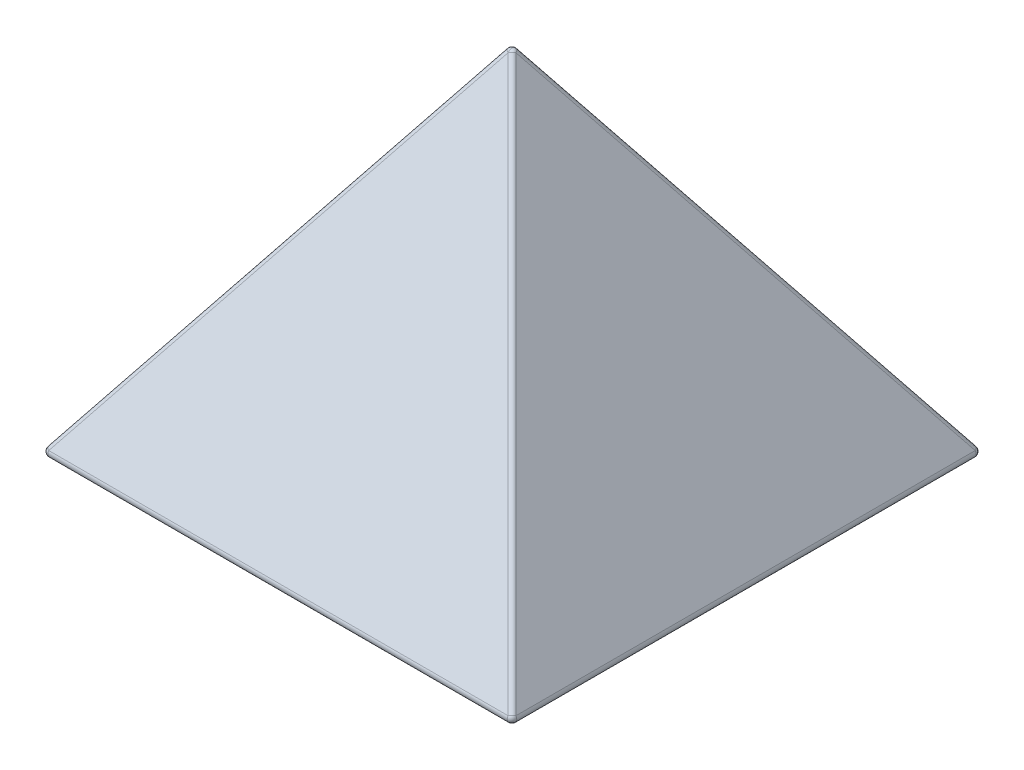
ISO-10303-21;
HEADER;
FILE_DESCRIPTION(('STEP AP214'),'2;1');
FILE_NAME('part.step','',(''),(''),'','','');
FILE_SCHEMA(('AUTOMOTIVE_DESIGN { 1 0 10303 214 1 1 1 1 }'));
ENDSEC;
DATA;
#1=APPLICATION_CONTEXT('core data for automotive mechanical design processes');
#2=APPLICATION_PROTOCOL_DEFINITION('international standard','automotive_design',2000,#1);
#3=PRODUCT_CONTEXT('',#1,'mechanical');
#4=PRODUCT('Part','Part','',(#3));
#5=PRODUCT_RELATED_PRODUCT_CATEGORY('part','',(#4));
#6=PRODUCT_DEFINITION_FORMATION('','',#4);
#7=PRODUCT_DEFINITION_CONTEXT('part definition',#1,'design');
#8=PRODUCT_DEFINITION('design','',#6,#7);
#9=PRODUCT_DEFINITION_SHAPE('','',#8);
#10=(LENGTH_UNIT() NAMED_UNIT(*) SI_UNIT(.MILLI.,.METRE.));
#11=(NAMED_UNIT(*) PLANE_ANGLE_UNIT() SI_UNIT($,.RADIAN.));
#12=(NAMED_UNIT(*) SI_UNIT($,.STERADIAN.) SOLID_ANGLE_UNIT());
#13=UNCERTAINTY_MEASURE_WITH_UNIT(LENGTH_MEASURE(1.E-05),#10,'distance_accuracy_value','');
#14=(GEOMETRIC_REPRESENTATION_CONTEXT(3) GLOBAL_UNCERTAINTY_ASSIGNED_CONTEXT((#13)) GLOBAL_UNIT_ASSIGNED_CONTEXT((#10,
#11,#12)) REPRESENTATION_CONTEXT('',''));
#15=CARTESIAN_POINT('',(0.,0.,0.));
#16=DIRECTION('',(0.,0.,1.));
#17=DIRECTION('',(1.,0.,0.));
#18=AXIS2_PLACEMENT_3D('',#15,#16,#17);
#19=CARTESIAN_POINT('',(0.,2.54,0.));
#20=DIRECTION('',(0.,-1.,0.));
#21=DIRECTION('',(0.,0.,-1.));
#22=AXIS2_PLACEMENT_3D('',#19,#20,#21);
#23=PLANE('',#22);
#24=DIRECTION('',(-1.,0.,0.));
#25=VECTOR('',#24,1.);
#26=CARTESIAN_POINT('',(0.,2.54,-46.0539665867738));
#27=LINE('',#26,#25);
#28=CARTESIAN_POINT('',(46.0539665867738,2.54,-46.0539665867738));
#29=VERTEX_POINT('',#28);
#30=CARTESIAN_POINT('',(-31.5228230502122,2.54000000000002,-46.0539665867738));
#31=VERTEX_POINT('',#30);
#32=EDGE_CURVE('E159',#29,#31,#27,.T.);
#33=ORIENTED_EDGE('',*,*,#32,.T.);
#34=CARTESIAN_POINT('',(-39.3939769497878,2.54000000000002,-46.0539665867738));
#35=VERTEX_POINT('',#34);
#36=EDGE_CURVE('E149',#31,#35,#27,.T.);
#37=ORIENTED_EDGE('',*,*,#36,.T.);
#38=CARTESIAN_POINT('',(-46.0539665867738,2.54,-46.0539665867738));
#39=VERTEX_POINT('',#38);
#40=EDGE_CURVE('E150',#35,#39,#27,.T.);
#41=ORIENTED_EDGE('',*,*,#40,.T.);
#42=DIRECTION('',(0.,0.,1.));
#43=VECTOR('',#42,1.);
#44=CARTESIAN_POINT('',(-46.0539665867738,2.54,0.));
#45=LINE('',#44,#43);
#46=CARTESIAN_POINT('',(-46.0539665867738,2.54,46.0539665867738));
#47=VERTEX_POINT('',#46);
#48=EDGE_CURVE('E166',#39,#47,#45,.T.);
#49=ORIENTED_EDGE('',*,*,#48,.T.);
#50=DIRECTION('',(1.,0.,0.));
#51=VECTOR('',#50,1.);
#52=CARTESIAN_POINT('',(0.,2.54,46.0539665867738));
#53=LINE('',#52,#51);
#54=CARTESIAN_POINT('',(46.0539665867738,2.54,46.0539665867738));
#55=VERTEX_POINT('',#54);
#56=EDGE_CURVE('E161',#47,#55,#53,.T.);
#57=ORIENTED_EDGE('',*,*,#56,.T.);
#58=DIRECTION('',(0.,0.,-1.));
#59=VECTOR('',#58,1.);
#60=CARTESIAN_POINT('',(46.0539665867738,2.54,0.));
#61=LINE('',#60,#59);
#62=EDGE_CURVE('E176',#55,#29,#61,.T.);
#63=ORIENTED_EDGE('',*,*,#62,.T.);
#64=EDGE_LOOP('',(#33,#37,#41,#49,#57,#63));
#65=FACE_BOUND('',#64,.T.);
#66=ADVANCED_FACE('F46',(#65),#23,.F.);
#67=CARTESIAN_POINT('',(33.0558230216126,22.0372153477418,0.));
#68=DIRECTION('',(0.832050294337844,0.554700196225229,0.));
#69=DIRECTION('',(-0.554700196225229,0.832050294337844,0.));
#70=AXIS2_PLACEMENT_3D('',#67,#68,#69);
#71=PLANE('',#70);
#72=ORIENTED_EDGE('',*,*,#62,.F.);
#73=DIRECTION('',(0.485071250072666,-0.727606875108999,0.485071250072666));
#74=VECTOR('',#73,1.);
#75=CARTESIAN_POINT('',(25.277982310645,33.7039764141933,25.277982310645));
#76=LINE('',#75,#74);
#77=CARTESIAN_POINT('',(0.,71.6209498801607,0.));
#78=VERTEX_POINT('',#77);
#79=EDGE_CURVE('E173',#78,#55,#76,.T.);
#80=ORIENTED_EDGE('',*,*,#79,.F.);
#81=DIRECTION('',(0.485071250072666,-0.727606875108999,-0.485071250072666));
#82=VECTOR('',#81,1.);
#83=CARTESIAN_POINT('',(25.277982310645,33.7039764141933,-25.277982310645));
#84=LINE('',#83,#82);
#85=EDGE_CURVE('E172',#78,#29,#84,.T.);
#86=ORIENTED_EDGE('',*,*,#85,.T.);
#87=EDGE_LOOP('',(#72,#80,#86));
#88=FACE_BOUND('',#87,.T.);
#89=ADVANCED_FACE('F296',(#88),#71,.F.);
#90=CARTESIAN_POINT('',(0.,22.0372153477418,-33.0558230216126));
#91=DIRECTION('',(0.,0.554700196225229,-0.832050294337844));
#92=DIRECTION('',(0.,0.832050294337844,0.554700196225229));
#93=AXIS2_PLACEMENT_3D('',#90,#91,#92);
#94=PLANE('',#93);
#95=ORIENTED_EDGE('',*,*,#40,.F.);
#96=CARTESIAN_POINT('',(-35.4584,5.98798861825136,-43.7553075079396));
#97=DIRECTION('',(0.,0.554700196225229,-0.832050294337844));
#98=DIRECTION('',(0.,0.832050294337844,0.554700196225229));
#99=AXIS2_PLACEMENT_3D('',#96,#97,#98);
#100=CIRCLE('',#99,5.71499999999992);
#101=EDGE_CURVE('E134',#35,#31,#100,.T.);
#102=ORIENTED_EDGE('',*,*,#101,.T.);
#103=ORIENTED_EDGE('',*,*,#32,.F.);
#104=ORIENTED_EDGE('',*,*,#85,.F.);
#105=DIRECTION('',(-0.485071250072666,-0.727606875108999,-0.485071250072666));
#106=VECTOR('',#105,1.);
#107=CARTESIAN_POINT('',(-25.277982310645,33.7039764141933,-25.277982310645));
#108=LINE('',#107,#106);
#109=EDGE_CURVE('E154',#78,#39,#108,.T.);
#110=ORIENTED_EDGE('',*,*,#109,.T.);
#111=EDGE_LOOP('',(#95,#102,#103,#104,#110));
#112=FACE_BOUND('',#111,.T.);
#113=ADVANCED_FACE('F152',(#112),#94,.F.);
#114=CARTESIAN_POINT('',(0.,22.0372153477418,33.0558230216126));
#115=DIRECTION('',(0.,0.554700196225229,0.832050294337844));
#116=DIRECTION('',(0.,-0.832050294337844,0.554700196225229));
#117=AXIS2_PLACEMENT_3D('',#114,#115,#116);
#118=PLANE('',#117);
#119=ORIENTED_EDGE('',*,*,#56,.F.);
#120=DIRECTION('',(-0.485071250072666,-0.727606875108999,0.485071250072666));
#121=VECTOR('',#120,1.);
#122=CARTESIAN_POINT('',(-25.277982310645,33.7039764141933,25.277982310645));
#123=LINE('',#122,#121);
#124=EDGE_CURVE('E169',#78,#47,#123,.T.);
#125=ORIENTED_EDGE('',*,*,#124,.F.);
#126=ORIENTED_EDGE('',*,*,#79,.T.);
#127=EDGE_LOOP('',(#119,#125,#126));
#128=FACE_BOUND('',#127,.T.);
#129=ADVANCED_FACE('F309',(#128),#118,.F.);
#130=CARTESIAN_POINT('',(-33.0558230216126,22.0372153477418,0.));
#131=DIRECTION('',(-0.832050294337844,0.554700196225229,0.));
#132=DIRECTION('',(-0.554700196225229,-0.832050294337844,0.));
#133=AXIS2_PLACEMENT_3D('',#130,#131,#132);
#134=PLANE('',#133);
#135=ORIENTED_EDGE('',*,*,#48,.F.);
#136=ORIENTED_EDGE('',*,*,#109,.F.);
#137=ORIENTED_EDGE('',*,*,#124,.T.);
#138=EDGE_LOOP('',(#135,#136,#137));
#139=FACE_BOUND('',#138,.T.);
#140=ADVANCED_FACE('F306',(#139),#134,.F.);
#141=CARTESIAN_POINT('',(-35.4584,5.98798861825136,-43.7553075079396));
#142=DIRECTION('',(0.,0.554700196225229,-0.832050294337844));
#143=DIRECTION('',(0.,0.832050294337844,0.554700196225229));
#144=AXIS2_PLACEMENT_3D('',#141,#142,#143);
#145=CYLINDRICAL_SURFACE('',#144,5.71499999999992);
#146=EDGE_CURVE('E138',#31,#35,#100,.T.);
#147=ORIENTED_EDGE('',*,*,#146,.F.);
#148=ORIENTED_EDGE('',*,*,#101,.F.);
#149=EDGE_LOOP('',(#147,#148));
#150=FACE_BOUND('',#149,.T.);
#151=CARTESIAN_POINT('',(-35.4584,7.39692711666344,-45.8687152555577));
#152=DIRECTION('',(0.,0.554700196225229,-0.832050294337844));
#153=DIRECTION('',(0.,0.832050294337844,0.554700196225229));
#154=AXIS2_PLACEMENT_3D('',#151,#152,#153);
#155=CIRCLE('',#154,5.71499999999992);
#156=CARTESIAN_POINT('',(-35.4584,12.1520945488042,-42.6986036341306));
#157=VERTEX_POINT('',#156);
#158=EDGE_CURVE('E144',#157,#157,#155,.T.);
#159=ORIENTED_EDGE('',*,*,#158,.T.);
#160=EDGE_LOOP('',(#159));
#161=FACE_BOUND('',#160,.T.);
#162=ADVANCED_FACE('F136',(#150,#161),#145,.F.);
#163=CARTESIAN_POINT('',(-35.4584,5.98798861825136,-43.7553075079396));
#164=DIRECTION('',(0.,0.554700196225229,-0.832050294337844));
#165=DIRECTION('',(0.,0.832050294337844,0.554700196225229));
#166=AXIS2_PLACEMENT_3D('',#163,#164,#165);
#167=PLANE('',#166);
#168=ORIENTED_EDGE('',*,*,#146,.T.);
#169=ORIENTED_EDGE('',*,*,#36,.F.);
#170=EDGE_LOOP('',(#168,#169));
#171=FACE_BOUND('',#170,.T.);
#172=ADVANCED_FACE('F147',(#171),#167,.T.);
#173=CARTESIAN_POINT('',(0.,0.,0.));
#174=DIRECTION('',(0.,-1.,0.));
#175=DIRECTION('',(0.,0.,-1.));
#176=AXIS2_PLACEMENT_3D('',#173,#174,#175);
#177=PLANE('',#176);
#178=DIRECTION('',(0.,0.,-1.));
#179=VECTOR('',#178,1.);
#180=CARTESIAN_POINT('',(48.9015866347095,0.,0.));
#181=LINE('',#180,#179);
#182=CARTESIAN_POINT('',(48.9015866347095,0.,-48.9015866347095));
#183=VERTEX_POINT('',#182);
#184=CARTESIAN_POINT('',(48.9015866347095,0.,48.9015866347095));
#185=VERTEX_POINT('',#184);
#186=EDGE_CURVE('E183',#183,#185,#181,.F.);
#187=ORIENTED_EDGE('',*,*,#186,.T.);
#188=DIRECTION('',(1.,0.,0.));
#189=VECTOR('',#188,1.);
#190=CARTESIAN_POINT('',(0.,0.,48.9015866347095));
#191=LINE('',#190,#189);
#192=CARTESIAN_POINT('',(-48.9015866347095,0.,48.9015866347095));
#193=VERTEX_POINT('',#192);
#194=EDGE_CURVE('E188',#185,#193,#191,.F.);
#195=ORIENTED_EDGE('',*,*,#194,.T.);
#196=DIRECTION('',(0.,0.,1.));
#197=VECTOR('',#196,1.);
#198=CARTESIAN_POINT('',(-48.9015866347095,0.,0.));
#199=LINE('',#198,#197);
#200=CARTESIAN_POINT('',(-48.9015866347095,0.,-48.9015866347095));
#201=VERTEX_POINT('',#200);
#202=EDGE_CURVE('E186',#193,#201,#199,.F.);
#203=ORIENTED_EDGE('',*,*,#202,.T.);
#204=DIRECTION('',(-1.,0.,0.));
#205=VECTOR('',#204,1.);
#206=CARTESIAN_POINT('',(0.,0.,-48.9015866347095));
#207=LINE('',#206,#205);
#208=EDGE_CURVE('E181',#201,#183,#207,.F.);
#209=ORIENTED_EDGE('',*,*,#208,.T.);
#210=EDGE_LOOP('',(#187,#195,#203,#209));
#211=FACE_BOUND('',#210,.T.);
#212=ADVANCED_FACE('F271',(#211),#177,.T.);
#213=CARTESIAN_POINT('',(-35.1692307692308,23.4461538461538,0.));
#214=DIRECTION('',(-0.832050294337844,0.554700196225229,0.));
#215=DIRECTION('',(-0.554700196225229,-0.832050294337844,0.));
#216=AXIS2_PLACEMENT_3D('',#213,#214,#215);
#217=PLANE('',#216);
#218=DIRECTION('',(0.,0.,1.));
#219=VECTOR('',#218,1.);
#220=CARTESIAN_POINT('',(-49.7469497337568,1.57957539936483,0.));
#221=LINE('',#220,#219);
#222=CARTESIAN_POINT('',(-49.7469497337568,1.57957539936483,-48.9015866347095));
#223=VERTEX_POINT('',#222);
#224=CARTESIAN_POINT('',(-49.7469497337568,1.57957539936483,48.9015866347095));
#225=VERTEX_POINT('',#224);
#226=EDGE_CURVE('E193',#223,#225,#221,.T.);
#227=ORIENTED_EDGE('',*,*,#226,.T.);
#228=DIRECTION('',(-0.485071250072666,-0.727606875108999,0.485071250072666));
#229=VECTOR('',#228,1.);
#230=CARTESIAN_POINT('',(-27.0930266115405,35.5604600826892,26.2476635124933));
#231=LINE('',#230,#229);
#232=CARTESIAN_POINT('',(-0.845363099047234,74.9319553514291,0.));
#233=VERTEX_POINT('',#232);
#234=EDGE_CURVE('E12',#225,#233,#231,.F.);
#235=ORIENTED_EDGE('',*,*,#234,.T.);
#236=DIRECTION('',(-0.485071250072666,-0.727606875108999,-0.485071250072666));
#237=VECTOR('',#236,1.);
#238=CARTESIAN_POINT('',(-27.0930266115405,35.5604600826892,-26.2476635124933));
#239=LINE('',#238,#237);
#240=EDGE_CURVE('E191',#233,#223,#239,.T.);
#241=ORIENTED_EDGE('',*,*,#240,.T.);
#242=EDGE_LOOP('',(#227,#235,#241));
#243=FACE_BOUND('',#242,.T.);
#244=ADVANCED_FACE('F284',(#243),#217,.T.);
#245=CARTESIAN_POINT('',(0.,23.4461538461538,35.1692307692308));
#246=DIRECTION('',(0.,0.554700196225229,0.832050294337844));
#247=DIRECTION('',(0.,-0.832050294337844,0.554700196225229));
#248=AXIS2_PLACEMENT_3D('',#245,#246,#247);
#249=PLANE('',#248);
#250=DIRECTION('',(1.,0.,0.));
#251=VECTOR('',#250,1.);
#252=CARTESIAN_POINT('',(0.,1.57957539936483,49.7469497337568));
#253=LINE('',#252,#251);
#254=CARTESIAN_POINT('',(-48.9015866347095,1.57957539936483,49.7469497337568));
#255=VERTEX_POINT('',#254);
#256=CARTESIAN_POINT('',(48.9015866347095,1.57957539936483,49.7469497337568));
#257=VERTEX_POINT('',#256);
#258=EDGE_CURVE('E179',#255,#257,#253,.T.);
#259=ORIENTED_EDGE('',*,*,#258,.T.);
#260=DIRECTION('',(0.485071250072666,-0.727606875108999,0.485071250072666));
#261=VECTOR('',#260,1.);
#262=CARTESIAN_POINT('',(26.2476635124933,35.5604600826892,27.0930266115405));
#263=LINE('',#262,#261);
#264=CARTESIAN_POINT('',(0.,74.9319553514291,0.845363099047254));
#265=VERTEX_POINT('',#264);
#266=EDGE_CURVE('E55',#257,#265,#263,.F.);
#267=ORIENTED_EDGE('',*,*,#266,.T.);
#268=DIRECTION('',(-0.485071250072666,-0.727606875108999,0.485071250072666));
#269=VECTOR('',#268,1.);
#270=CARTESIAN_POINT('',(-26.2476635124933,35.5604600826892,27.0930266115405));
#271=LINE('',#270,#269);
#272=EDGE_CURVE('E239',#265,#255,#271,.T.);
#273=ORIENTED_EDGE('',*,*,#272,.T.);
#274=EDGE_LOOP('',(#259,#267,#273));
#275=FACE_BOUND('',#274,.T.);
#276=ADVANCED_FACE('F281',(#275),#249,.T.);
#277=CARTESIAN_POINT('',(0.,23.4461538461538,-35.1692307692308));
#278=DIRECTION('',(0.,0.554700196225229,-0.832050294337844));
#279=DIRECTION('',(0.,0.832050294337844,0.554700196225229));
#280=AXIS2_PLACEMENT_3D('',#277,#278,#279);
#281=PLANE('',#280);
#282=DIRECTION('',(-1.,0.,0.));
#283=VECTOR('',#282,1.);
#284=CARTESIAN_POINT('',(0.,1.57957539936483,-49.7469497337568));
#285=LINE('',#284,#283);
#286=CARTESIAN_POINT('',(48.9015866347095,1.57957539936483,-49.7469497337568));
#287=VERTEX_POINT('',#286);
#288=CARTESIAN_POINT('',(-48.9015866347095,1.57957539936483,-49.7469497337568));
#289=VERTEX_POINT('',#288);
#290=EDGE_CURVE('E197',#287,#289,#285,.T.);
#291=ORIENTED_EDGE('',*,*,#290,.T.);
#292=DIRECTION('',(-0.485071250072666,-0.727606875108999,-0.485071250072666));
#293=VECTOR('',#292,1.);
#294=CARTESIAN_POINT('',(-26.2476635124933,35.5604600826892,-27.0930266115405));
#295=LINE('',#294,#293);
#296=CARTESIAN_POINT('',(0.,74.9319553514291,-0.845363099047255));
#297=VERTEX_POINT('',#296);
#298=EDGE_CURVE('E199',#289,#297,#295,.F.);
#299=ORIENTED_EDGE('',*,*,#298,.T.);
#300=DIRECTION('',(0.485071250072666,-0.727606875108999,-0.485071250072666));
#301=VECTOR('',#300,1.);
#302=CARTESIAN_POINT('',(26.2476635124933,35.5604600826892,-27.0930266115405));
#303=LINE('',#302,#301);
#304=EDGE_CURVE('E195',#297,#287,#303,.T.);
#305=ORIENTED_EDGE('',*,*,#304,.T.);
#306=EDGE_LOOP('',(#291,#299,#305));
#307=FACE_BOUND('',#306,.T.);
#308=ORIENTED_EDGE('',*,*,#158,.F.);
#309=EDGE_LOOP('',(#308));
#310=FACE_BOUND('',#309,.T.);
#311=ADVANCED_FACE('F283',(#307,#310),#281,.T.);
#312=CARTESIAN_POINT('',(35.1692307692308,23.4461538461538,0.));
#313=DIRECTION('',(0.832050294337844,0.554700196225229,0.));
#314=DIRECTION('',(-0.554700196225229,0.832050294337844,0.));
#315=AXIS2_PLACEMENT_3D('',#312,#313,#314);
#316=PLANE('',#315);
#317=DIRECTION('',(0.485071250072666,-0.727606875108999,-0.485071250072666));
#318=VECTOR('',#317,1.);
#319=CARTESIAN_POINT('',(27.0930266115405,35.5604600826892,-26.2476635124933));
#320=LINE('',#319,#318);
#321=CARTESIAN_POINT('',(49.7469497337568,1.57957539936483,-48.9015866347095));
#322=VERTEX_POINT('',#321);
#323=CARTESIAN_POINT('',(0.845363099047237,74.9319553514291,0.));
#324=VERTEX_POINT('',#323);
#325=EDGE_CURVE('E202',#322,#324,#320,.F.);
#326=ORIENTED_EDGE('',*,*,#325,.T.);
#327=DIRECTION('',(0.485071250072666,-0.727606875108999,0.485071250072666));
#328=VECTOR('',#327,1.);
#329=CARTESIAN_POINT('',(27.0930266115405,35.5604600826892,26.2476635124933));
#330=LINE('',#329,#328);
#331=CARTESIAN_POINT('',(49.7469497337568,1.57957539936483,48.9015866347095));
#332=VERTEX_POINT('',#331);
#333=EDGE_CURVE('E237',#324,#332,#330,.T.);
#334=ORIENTED_EDGE('',*,*,#333,.T.);
#335=DIRECTION('',(0.,0.,-1.));
#336=VECTOR('',#335,1.);
#337=CARTESIAN_POINT('',(49.7469497337568,1.57957539936483,0.));
#338=LINE('',#337,#336);
#339=EDGE_CURVE('E205',#332,#322,#338,.T.);
#340=ORIENTED_EDGE('',*,*,#339,.T.);
#341=EDGE_LOOP('',(#326,#334,#340));
#342=FACE_BOUND('',#341,.T.);
#343=ADVANCED_FACE('F290',(#342),#316,.T.);
#344=CARTESIAN_POINT('',(-26.2476635124933,34.9968846833244,-26.2476635124933));
#345=DIRECTION('',(-0.485071250072666,-0.727606875108999,-0.485071250072666));
#346=DIRECTION('',(0.832050294337844,-0.554700196225229,0.));
#347=AXIS2_PLACEMENT_3D('',#344,#345,#346);
#348=CYLINDRICAL_SURFACE('',#347,1.016);
#349=ORIENTED_EDGE('',*,*,#240,.F.);
#350=CARTESIAN_POINT('',(0.,74.3683799520643,0.));
#351=DIRECTION('',(-0.485071250072666,-0.727606875108999,-0.485071250072666));
#352=DIRECTION('',(0.832050294337844,-0.554700196225229,0.));
#353=AXIS2_PLACEMENT_3D('',#350,#351,#352);
#354=CIRCLE('',#353,1.016);
#355=EDGE_CURVE('E234',#233,#297,#354,.T.);
#356=ORIENTED_EDGE('',*,*,#355,.T.);
#357=ORIENTED_EDGE('',*,*,#298,.F.);
#358=CARTESIAN_POINT('',(-48.9015866347095,1.016,-48.9015866347095));
#359=DIRECTION('',(-0.485071250072667,-0.727606875109001,-0.485071250072662));
#360=DIRECTION('',(0.832050294337844,-0.554700196225228,0.));
#361=AXIS2_PLACEMENT_3D('',#358,#359,#360);
#362=CIRCLE('',#361,1.016);
#363=EDGE_CURVE('E220',#223,#289,#362,.T.);
#364=ORIENTED_EDGE('',*,*,#363,.F.);
#365=EDGE_LOOP('',(#349,#356,#357,#364));
#366=FACE_BOUND('',#365,.T.);
#367=ADVANCED_FACE('F381',(#366),#348,.T.);
#368=CARTESIAN_POINT('',(26.2476635124933,34.9968846833244,-26.2476635124933));
#369=DIRECTION('',(0.485071250072666,-0.727606875108999,-0.485071250072666));
#370=DIRECTION('',(0.,0.554700196225229,-0.832050294337844));
#371=AXIS2_PLACEMENT_3D('',#368,#369,#370);
#372=CYLINDRICAL_SURFACE('',#371,1.016);
#373=ORIENTED_EDGE('',*,*,#304,.F.);
#374=CARTESIAN_POINT('',(0.,74.3683799520643,0.));
#375=DIRECTION('',(0.485071250072666,-0.727606875108999,-0.485071250072666));
#376=DIRECTION('',(0.,0.554700196225229,-0.832050294337844));
#377=AXIS2_PLACEMENT_3D('',#374,#375,#376);
#378=CIRCLE('',#377,1.016);
#379=EDGE_CURVE('E207',#297,#324,#378,.T.);
#380=ORIENTED_EDGE('',*,*,#379,.T.);
#381=ORIENTED_EDGE('',*,*,#325,.F.);
#382=CARTESIAN_POINT('',(48.9015866347095,1.016,-48.9015866347095));
#383=DIRECTION('',(0.48507125007266,-0.727606875109002,-0.485071250072667));
#384=DIRECTION('',(0.,0.554700196225228,-0.832050294337844));
#385=AXIS2_PLACEMENT_3D('',#382,#383,#384);
#386=CIRCLE('',#385,1.016);
#387=EDGE_CURVE('E217',#287,#322,#386,.T.);
#388=ORIENTED_EDGE('',*,*,#387,.F.);
#389=EDGE_LOOP('',(#373,#380,#381,#388));
#390=FACE_BOUND('',#389,.T.);
#391=ADVANCED_FACE('F385',(#390),#372,.T.);
#392=CARTESIAN_POINT('',(0.,1.016,-48.9015866347095));
#393=DIRECTION('',(-1.,0.,0.));
#394=DIRECTION('',(0.,0.,1.));
#395=AXIS2_PLACEMENT_3D('',#392,#393,#394);
#396=CYLINDRICAL_SURFACE('',#395,1.016);
#397=CARTESIAN_POINT('',(-48.9015866347095,1.016,-48.9015866347095));
#398=DIRECTION('',(-1.,0.,0.));
#399=DIRECTION('',(0.,0.,1.));
#400=AXIS2_PLACEMENT_3D('',#397,#398,#399);
#401=CIRCLE('',#400,1.016);
#402=EDGE_CURVE('E223',#289,#201,#401,.T.);
#403=ORIENTED_EDGE('',*,*,#402,.F.);
#404=ORIENTED_EDGE('',*,*,#290,.F.);
#405=CARTESIAN_POINT('',(48.9015866347095,1.016,-48.9015866347095));
#406=DIRECTION('',(1.,0.,0.));
#407=DIRECTION('',(0.,0.,-1.));
#408=AXIS2_PLACEMENT_3D('',#405,#406,#407);
#409=CIRCLE('',#408,1.016);
#410=EDGE_CURVE('E214',#183,#287,#409,.T.);
#411=ORIENTED_EDGE('',*,*,#410,.F.);
#412=ORIENTED_EDGE('',*,*,#208,.F.);
#413=EDGE_LOOP('',(#403,#404,#411,#412));
#414=FACE_BOUND('',#413,.T.);
#415=ADVANCED_FACE('F395',(#414),#396,.T.);
#416=CARTESIAN_POINT('',(-48.9015866347095,1.016,-48.9015866347095));
#417=DIRECTION('',(0.,-1.,0.));
#418=DIRECTION('',(0.,0.,-1.));
#419=AXIS2_PLACEMENT_3D('',#416,#417,#418);
#420=SPHERICAL_SURFACE('',#419,1.016);
#421=ORIENTED_EDGE('',*,*,#363,.T.);
#422=ORIENTED_EDGE('',*,*,#402,.T.);
#423=CARTESIAN_POINT('',(-48.9015866347095,1.016,-48.9015866347095));
#424=DIRECTION('',(0.,0.,-1.));
#425=DIRECTION('',(-1.,0.,0.));
#426=AXIS2_PLACEMENT_3D('',#423,#424,#425);
#427=CIRCLE('',#426,1.016);
#428=EDGE_CURVE('E211',#223,#201,#427,.F.);
#429=ORIENTED_EDGE('',*,*,#428,.F.);
#430=EDGE_LOOP('',(#421,#422,#429));
#431=FACE_BOUND('',#430,.T.);
#432=ADVANCED_FACE('F405',(#431),#420,.T.);
#433=CARTESIAN_POINT('',(48.9015866347095,1.016,-48.9015866347095));
#434=DIRECTION('',(0.,-1.,0.));
#435=DIRECTION('',(1.,0.,0.));
#436=AXIS2_PLACEMENT_3D('',#433,#434,#435);
#437=SPHERICAL_SURFACE('',#436,1.016);
#438=ORIENTED_EDGE('',*,*,#410,.T.);
#439=ORIENTED_EDGE('',*,*,#387,.T.);
#440=CARTESIAN_POINT('',(48.9015866347095,1.016,-48.9015866347095));
#441=DIRECTION('',(0.,0.,-1.));
#442=DIRECTION('',(-1.,0.,0.));
#443=AXIS2_PLACEMENT_3D('',#440,#441,#442);
#444=CIRCLE('',#443,1.016);
#445=EDGE_CURVE('E208',#183,#322,#444,.F.);
#446=ORIENTED_EDGE('',*,*,#445,.F.);
#447=EDGE_LOOP('',(#438,#439,#446));
#448=FACE_BOUND('',#447,.T.);
#449=ADVANCED_FACE('F415',(#448),#437,.T.);
#450=CARTESIAN_POINT('',(-48.9015866347095,1.016,0.));
#451=DIRECTION('',(0.,0.,1.));
#452=DIRECTION('',(1.,0.,0.));
#453=AXIS2_PLACEMENT_3D('',#450,#451,#452);
#454=CYLINDRICAL_SURFACE('',#453,1.016);
#455=ORIENTED_EDGE('',*,*,#202,.F.);
#456=CARTESIAN_POINT('',(-48.9015866347095,1.016,48.9015866347095));
#457=DIRECTION('',(0.,0.,1.));
#458=DIRECTION('',(1.,0.,0.));
#459=AXIS2_PLACEMENT_3D('',#456,#457,#458);
#460=CIRCLE('',#459,1.016);
#461=EDGE_CURVE('E70',#193,#225,#460,.F.);
#462=ORIENTED_EDGE('',*,*,#461,.T.);
#463=ORIENTED_EDGE('',*,*,#226,.F.);
#464=ORIENTED_EDGE('',*,*,#428,.T.);
#465=EDGE_LOOP('',(#455,#462,#463,#464));
#466=FACE_BOUND('',#465,.T.);
#467=ADVANCED_FACE('F267',(#466),#454,.T.);
#468=CARTESIAN_POINT('',(48.9015866347095,1.016,0.));
#469=DIRECTION('',(0.,0.,-1.));
#470=DIRECTION('',(-1.,0.,0.));
#471=AXIS2_PLACEMENT_3D('',#468,#469,#470);
#472=CYLINDRICAL_SURFACE('',#471,1.016);
#473=ORIENTED_EDGE('',*,*,#339,.F.);
#474=CARTESIAN_POINT('',(48.9015866347095,1.016,48.9015866347095));
#475=DIRECTION('',(0.,0.,-1.));
#476=DIRECTION('',(-1.,0.,0.));
#477=AXIS2_PLACEMENT_3D('',#474,#475,#476);
#478=CIRCLE('',#477,1.016);
#479=EDGE_CURVE('E232',#332,#185,#478,.T.);
#480=ORIENTED_EDGE('',*,*,#479,.T.);
#481=ORIENTED_EDGE('',*,*,#186,.F.);
#482=ORIENTED_EDGE('',*,*,#445,.T.);
#483=EDGE_LOOP('',(#473,#480,#481,#482));
#484=FACE_BOUND('',#483,.T.);
#485=ADVANCED_FACE('F276',(#484),#472,.T.);
#486=CARTESIAN_POINT('',(0.,1.016,48.9015866347095));
#487=DIRECTION('',(1.,0.,0.));
#488=DIRECTION('',(0.,0.,-1.));
#489=AXIS2_PLACEMENT_3D('',#486,#487,#488);
#490=CYLINDRICAL_SURFACE('',#489,1.016);
#491=ORIENTED_EDGE('',*,*,#194,.F.);
#492=CARTESIAN_POINT('',(48.9015866347095,1.016,48.9015866347095));
#493=DIRECTION('',(1.,0.,0.));
#494=DIRECTION('',(0.,0.,-1.));
#495=AXIS2_PLACEMENT_3D('',#492,#493,#494);
#496=CIRCLE('',#495,1.016);
#497=EDGE_CURVE('E230',#185,#257,#496,.F.);
#498=ORIENTED_EDGE('',*,*,#497,.T.);
#499=ORIENTED_EDGE('',*,*,#258,.F.);
#500=CARTESIAN_POINT('',(-48.9015866347095,1.016,48.9015866347095));
#501=DIRECTION('',(1.,0.,0.));
#502=DIRECTION('',(0.,0.,-1.));
#503=AXIS2_PLACEMENT_3D('',#500,#501,#502);
#504=CIRCLE('',#503,1.016);
#505=EDGE_CURVE('E228',#255,#193,#504,.T.);
#506=ORIENTED_EDGE('',*,*,#505,.T.);
#507=EDGE_LOOP('',(#491,#498,#499,#506));
#508=FACE_BOUND('',#507,.T.);
#509=ADVANCED_FACE('F265',(#508),#490,.T.);
#510=CARTESIAN_POINT('',(-48.9015866347095,1.016,48.9015866347095));
#511=DIRECTION('',(0.,0.,1.));
#512=DIRECTION('',(1.,0.,0.));
#513=AXIS2_PLACEMENT_3D('',#510,#511,#512);
#514=SPHERICAL_SURFACE('',#513,1.016);
#515=ORIENTED_EDGE('',*,*,#461,.F.);
#516=ORIENTED_EDGE('',*,*,#505,.F.);
#517=CARTESIAN_POINT('',(-48.9015866347095,1.016,48.9015866347095));
#518=DIRECTION('',(0.485071250072662,0.727606875109009,-0.485071250072654));
#519=DIRECTION('',(-0.832050294337849,0.554700196225221,0.));
#520=AXIS2_PLACEMENT_3D('',#517,#518,#519);
#521=CIRCLE('',#520,1.016);
#522=EDGE_CURVE('E50',#225,#255,#521,.T.);
#523=ORIENTED_EDGE('',*,*,#522,.F.);
#524=EDGE_LOOP('',(#515,#516,#523));
#525=FACE_BOUND('',#524,.T.);
#526=ADVANCED_FACE('F48',(#525),#514,.T.);
#527=CARTESIAN_POINT('',(48.9015866347095,1.016,48.9015866347095));
#528=DIRECTION('',(0.,0.,1.));
#529=DIRECTION('',(1.,0.,0.));
#530=AXIS2_PLACEMENT_3D('',#527,#528,#529);
#531=SPHERICAL_SURFACE('',#530,1.016);
#532=ORIENTED_EDGE('',*,*,#497,.F.);
#533=ORIENTED_EDGE('',*,*,#479,.F.);
#534=CARTESIAN_POINT('',(48.9015866347095,1.016,48.9015866347095));
#535=DIRECTION('',(-0.48507125007267,0.727606875108999,-0.485071250072663));
#536=DIRECTION('',(-0.832050294337842,-0.554700196225232,0.));
#537=AXIS2_PLACEMENT_3D('',#534,#535,#536);
#538=CIRCLE('',#537,1.016);
#539=EDGE_CURVE('E249',#257,#332,#538,.T.);
#540=ORIENTED_EDGE('',*,*,#539,.F.);
#541=EDGE_LOOP('',(#532,#533,#540));
#542=FACE_BOUND('',#541,.T.);
#543=ADVANCED_FACE('F280',(#542),#531,.T.);
#544=CARTESIAN_POINT('',(-26.2476635124933,34.9968846833244,26.2476635124933));
#545=DIRECTION('',(-0.485071250072666,-0.727606875108999,0.485071250072666));
#546=DIRECTION('',(0.832050294337844,-0.554700196225229,0.));
#547=AXIS2_PLACEMENT_3D('',#544,#545,#546);
#548=CYLINDRICAL_SURFACE('',#547,1.016);
#549=ORIENTED_EDGE('',*,*,#522,.T.);
#550=ORIENTED_EDGE('',*,*,#272,.F.);
#551=CARTESIAN_POINT('',(0.,74.3683799520643,0.));
#552=DIRECTION('',(0.485071250072665,0.727606875109001,-0.485071250072664));
#553=DIRECTION('',(-0.832050294337845,0.554700196225227,0.));
#554=AXIS2_PLACEMENT_3D('',#551,#552,#553);
#555=CIRCLE('',#554,1.016);
#556=EDGE_CURVE('E247',#233,#265,#555,.T.);
#557=ORIENTED_EDGE('',*,*,#556,.F.);
#558=ORIENTED_EDGE('',*,*,#234,.F.);
#559=EDGE_LOOP('',(#549,#550,#557,#558));
#560=FACE_BOUND('',#559,.T.);
#561=ADVANCED_FACE('F258',(#560),#548,.T.);
#562=CARTESIAN_POINT('',(26.2476635124933,34.9968846833244,26.2476635124933));
#563=DIRECTION('',(0.485071250072666,-0.727606875108999,0.485071250072666));
#564=DIRECTION('',(0.,-0.554700196225229,-0.832050294337844));
#565=AXIS2_PLACEMENT_3D('',#562,#563,#564);
#566=CYLINDRICAL_SURFACE('',#565,1.016);
#567=ORIENTED_EDGE('',*,*,#539,.T.);
#568=ORIENTED_EDGE('',*,*,#333,.F.);
#569=CARTESIAN_POINT('',(0.,74.3683799520643,0.));
#570=DIRECTION('',(-0.485071250072665,0.727606875109001,-0.485071250072664));
#571=DIRECTION('',(-0.832050294337845,-0.554700196225227,0.));
#572=AXIS2_PLACEMENT_3D('',#569,#570,#571);
#573=CIRCLE('',#572,1.016);
#574=EDGE_CURVE('E245',#265,#324,#573,.T.);
#575=ORIENTED_EDGE('',*,*,#574,.F.);
#576=ORIENTED_EDGE('',*,*,#266,.F.);
#577=EDGE_LOOP('',(#567,#568,#575,#576));
#578=FACE_BOUND('',#577,.T.);
#579=ADVANCED_FACE('F477',(#578),#566,.T.);
#580=CARTESIAN_POINT('',(0.,74.3683799520643,0.));
#581=DIRECTION('',(0.,0.554700196225229,0.832050294337844));
#582=DIRECTION('',(0.,-0.832050294337844,0.554700196225229));
#583=AXIS2_PLACEMENT_3D('',#580,#581,#582);
#584=SPHERICAL_SURFACE('',#583,1.016);
#585=ORIENTED_EDGE('',*,*,#355,.F.);
#586=ORIENTED_EDGE('',*,*,#556,.T.);
#587=CARTESIAN_POINT('',(0.,74.3683799520643,0.));
#588=DIRECTION('',(1.,0.,0.));
#589=DIRECTION('',(0.,0.,-1.));
#590=AXIS2_PLACEMENT_3D('',#587,#588,#589);
#591=CIRCLE('',#590,1.016);
#592=EDGE_CURVE('E242',#297,#265,#591,.T.);
#593=ORIENTED_EDGE('',*,*,#592,.F.);
#594=EDGE_LOOP('',(#585,#586,#593));
#595=FACE_BOUND('',#594,.T.);
#596=ADVANCED_FACE('F486',(#595),#584,.T.);
#597=CARTESIAN_POINT('',(0.,74.3683799520643,0.));
#598=DIRECTION('',(0.,0.554700196225229,0.832050294337844));
#599=DIRECTION('',(0.,-0.832050294337844,0.554700196225229));
#600=AXIS2_PLACEMENT_3D('',#597,#598,#599);
#601=SPHERICAL_SURFACE('',#600,1.016);
#602=ORIENTED_EDGE('',*,*,#574,.T.);
#603=ORIENTED_EDGE('',*,*,#379,.F.);
#604=ORIENTED_EDGE('',*,*,#592,.T.);
#605=EDGE_LOOP('',(#602,#603,#604));
#606=FACE_BOUND('',#605,.T.);
#607=ADVANCED_FACE('F495',(#606),#601,.T.);
#608=CLOSED_SHELL('',(#66,#89,#113,#129,#140,#162,#172,#212,#244,#276,#311,#343,#367,#391,#415,
#432,#449,#467,#485,#509,#526,#543,#561,#579,#596,#607));
#609=MANIFOLD_SOLID_BREP('B2',#608);
#610=ADVANCED_BREP_SHAPE_REPRESENTATION('',(#18,#609),#14);
#611=SHAPE_DEFINITION_REPRESENTATION(#9,#610);
ENDSEC;
END-ISO-10303-21;
